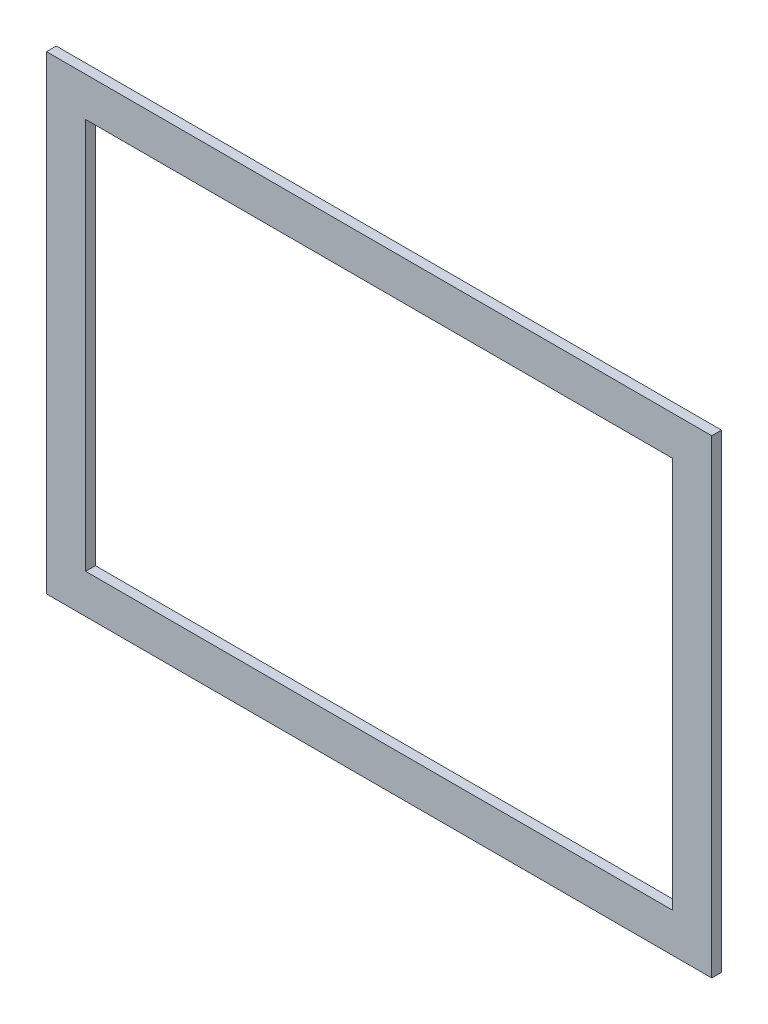
ISO-10303-21;
HEADER;
FILE_DESCRIPTION(('STEP AP214'),'2;1');
FILE_NAME('part.step','',(''),(''),'','','');
FILE_SCHEMA(('AUTOMOTIVE_DESIGN { 1 0 10303 214 1 1 1 1 }'));
ENDSEC;
DATA;
#1=APPLICATION_CONTEXT('core data for automotive mechanical design processes');
#2=APPLICATION_PROTOCOL_DEFINITION('international standard','automotive_design',2000,#1);
#3=PRODUCT_CONTEXT('',#1,'mechanical');
#4=PRODUCT('Part','Part','',(#3));
#5=PRODUCT_RELATED_PRODUCT_CATEGORY('part','',(#4));
#6=PRODUCT_DEFINITION_FORMATION('','',#4);
#7=PRODUCT_DEFINITION_CONTEXT('part definition',#1,'design');
#8=PRODUCT_DEFINITION('design','',#6,#7);
#9=PRODUCT_DEFINITION_SHAPE('','',#8);
#10=(LENGTH_UNIT() NAMED_UNIT(*) SI_UNIT(.MILLI.,.METRE.));
#11=(NAMED_UNIT(*) PLANE_ANGLE_UNIT() SI_UNIT($,.RADIAN.));
#12=(NAMED_UNIT(*) SI_UNIT($,.STERADIAN.) SOLID_ANGLE_UNIT());
#13=UNCERTAINTY_MEASURE_WITH_UNIT(LENGTH_MEASURE(1.E-05),#10,'distance_accuracy_value','');
#14=(GEOMETRIC_REPRESENTATION_CONTEXT(3) GLOBAL_UNCERTAINTY_ASSIGNED_CONTEXT((#13)) GLOBAL_UNIT_ASSIGNED_CONTEXT((#10,
#11,#12)) REPRESENTATION_CONTEXT('',''));
#15=CARTESIAN_POINT('',(0.,0.,0.));
#16=DIRECTION('',(0.,0.,1.));
#17=DIRECTION('',(1.,0.,0.));
#18=AXIS2_PLACEMENT_3D('',#15,#16,#17);
#19=CARTESIAN_POINT('',(0.,0.,10.));
#20=DIRECTION('',(0.,0.,1.));
#21=DIRECTION('',(1.,0.,0.));
#22=AXIS2_PLACEMENT_3D('',#19,#20,#21);
#23=PLANE('',#22);
#24=DIRECTION('',(0.,1.,0.));
#25=VECTOR('',#24,1.);
#26=CARTESIAN_POINT('',(0.,0.,10.));
#27=LINE('',#26,#25);
#28=CARTESIAN_POINT('',(0.,0.,10.));
#29=VERTEX_POINT('',#28);
#30=CARTESIAN_POINT('',(0.,480.,10.));
#31=VERTEX_POINT('',#30);
#32=EDGE_CURVE('E134',#29,#31,#27,.T.);
#33=ORIENTED_EDGE('',*,*,#32,.T.);
#34=DIRECTION('',(-1.,0.,0.));
#35=VECTOR('',#34,1.);
#36=CARTESIAN_POINT('',(0.,480.,10.));
#37=LINE('',#36,#35);
#38=CARTESIAN_POINT('',(-680.,480.,10.));
#39=VERTEX_POINT('',#38);
#40=EDGE_CURVE('E137',#31,#39,#37,.T.);
#41=ORIENTED_EDGE('',*,*,#40,.T.);
#42=DIRECTION('',(0.,-1.,0.));
#43=VECTOR('',#42,1.);
#44=CARTESIAN_POINT('',(-680.,0.,10.));
#45=LINE('',#44,#43);
#46=CARTESIAN_POINT('',(-680.,0.,10.));
#47=VERTEX_POINT('',#46);
#48=EDGE_CURVE('E140',#39,#47,#45,.T.);
#49=ORIENTED_EDGE('',*,*,#48,.T.);
#50=DIRECTION('',(1.,0.,0.));
#51=VECTOR('',#50,1.);
#52=CARTESIAN_POINT('',(0.,0.,10.));
#53=LINE('',#52,#51);
#54=EDGE_CURVE('E142',#47,#29,#53,.T.);
#55=ORIENTED_EDGE('',*,*,#54,.T.);
#56=EDGE_LOOP('',(#33,#41,#49,#55));
#57=FACE_BOUND('',#56,.T.);
#58=DIRECTION('',(1.,0.,0.));
#59=VECTOR('',#58,1.);
#60=CARTESIAN_POINT('',(-640.,39.9999999999999,10.));
#61=LINE('',#60,#59);
#62=CARTESIAN_POINT('',(-640.,39.9999999999999,10.));
#63=VERTEX_POINT('',#62);
#64=CARTESIAN_POINT('',(-40.,39.9999999999999,10.));
#65=VERTEX_POINT('',#64);
#66=EDGE_CURVE('E106',#63,#65,#61,.T.);
#67=ORIENTED_EDGE('',*,*,#66,.F.);
#68=DIRECTION('',(0.,-1.,0.));
#69=VECTOR('',#68,1.);
#70=CARTESIAN_POINT('',(-640.,440.,10.));
#71=LINE('',#70,#69);
#72=CARTESIAN_POINT('',(-640.,440.,10.));
#73=VERTEX_POINT('',#72);
#74=EDGE_CURVE('E98',#73,#63,#71,.T.);
#75=ORIENTED_EDGE('',*,*,#74,.F.);
#76=DIRECTION('',(-1.,0.,0.));
#77=VECTOR('',#76,1.);
#78=CARTESIAN_POINT('',(-640.,440.,10.));
#79=LINE('',#78,#77);
#80=CARTESIAN_POINT('',(-40.,440.,10.));
#81=VERTEX_POINT('',#80);
#82=EDGE_CURVE('E120',#81,#73,#79,.T.);
#83=ORIENTED_EDGE('',*,*,#82,.F.);
#84=DIRECTION('',(0.,1.,0.));
#85=VECTOR('',#84,1.);
#86=CARTESIAN_POINT('',(-40.,440.,10.));
#87=LINE('',#86,#85);
#88=EDGE_CURVE('E118',#65,#81,#87,.T.);
#89=ORIENTED_EDGE('',*,*,#88,.F.);
#90=EDGE_LOOP('',(#67,#75,#83,#89));
#91=FACE_BOUND('',#90,.T.);
#92=ADVANCED_FACE('F33',(#57,#91),#23,.T.);
#93=CARTESIAN_POINT('',(0.,0.,0.));
#94=DIRECTION('',(0.,0.,1.));
#95=DIRECTION('',(1.,0.,0.));
#96=AXIS2_PLACEMENT_3D('',#93,#94,#95);
#97=PLANE('',#96);
#98=DIRECTION('',(0.,1.,0.));
#99=VECTOR('',#98,1.);
#100=CARTESIAN_POINT('',(0.,0.,0.));
#101=LINE('',#100,#99);
#102=CARTESIAN_POINT('',(0.,0.,0.));
#103=VERTEX_POINT('',#102);
#104=CARTESIAN_POINT('',(0.,480.,0.));
#105=VERTEX_POINT('',#104);
#106=EDGE_CURVE('E114',#103,#105,#101,.T.);
#107=ORIENTED_EDGE('',*,*,#106,.F.);
#108=DIRECTION('',(1.,0.,0.));
#109=VECTOR('',#108,1.);
#110=CARTESIAN_POINT('',(0.,0.,0.));
#111=LINE('',#110,#109);
#112=CARTESIAN_POINT('',(-680.,0.,0.));
#113=VERTEX_POINT('',#112);
#114=EDGE_CURVE('E138',#113,#103,#111,.T.);
#115=ORIENTED_EDGE('',*,*,#114,.F.);
#116=DIRECTION('',(0.,-1.,0.));
#117=VECTOR('',#116,1.);
#118=CARTESIAN_POINT('',(-680.,0.,0.));
#119=LINE('',#118,#117);
#120=CARTESIAN_POINT('',(-680.,480.,0.));
#121=VERTEX_POINT('',#120);
#122=EDGE_CURVE('E149',#121,#113,#119,.T.);
#123=ORIENTED_EDGE('',*,*,#122,.F.);
#124=DIRECTION('',(-1.,0.,0.));
#125=VECTOR('',#124,1.);
#126=CARTESIAN_POINT('',(0.,480.,0.));
#127=LINE('',#126,#125);
#128=EDGE_CURVE('E147',#105,#121,#127,.T.);
#129=ORIENTED_EDGE('',*,*,#128,.F.);
#130=EDGE_LOOP('',(#107,#115,#123,#129));
#131=FACE_BOUND('',#130,.T.);
#132=DIRECTION('',(0.,-1.,0.));
#133=VECTOR('',#132,1.);
#134=CARTESIAN_POINT('',(-640.,440.,0.));
#135=LINE('',#134,#133);
#136=CARTESIAN_POINT('',(-640.,440.,0.));
#137=VERTEX_POINT('',#136);
#138=CARTESIAN_POINT('',(-640.,39.9999999999999,0.));
#139=VERTEX_POINT('',#138);
#140=EDGE_CURVE('E56',#137,#139,#135,.T.);
#141=ORIENTED_EDGE('',*,*,#140,.T.);
#142=DIRECTION('',(1.,0.,0.));
#143=VECTOR('',#142,1.);
#144=CARTESIAN_POINT('',(-640.,39.9999999999999,0.));
#145=LINE('',#144,#143);
#146=CARTESIAN_POINT('',(-40.,39.9999999999999,0.));
#147=VERTEX_POINT('',#146);
#148=EDGE_CURVE('E113',#139,#147,#145,.T.);
#149=ORIENTED_EDGE('',*,*,#148,.T.);
#150=DIRECTION('',(0.,1.,0.));
#151=VECTOR('',#150,1.);
#152=CARTESIAN_POINT('',(-40.,440.,0.));
#153=LINE('',#152,#151);
#154=CARTESIAN_POINT('',(-40.,440.,0.));
#155=VERTEX_POINT('',#154);
#156=EDGE_CURVE('E126',#147,#155,#153,.T.);
#157=ORIENTED_EDGE('',*,*,#156,.T.);
#158=DIRECTION('',(-1.,0.,0.));
#159=VECTOR('',#158,1.);
#160=CARTESIAN_POINT('',(-640.,440.,0.));
#161=LINE('',#160,#159);
#162=EDGE_CURVE('E107',#155,#137,#161,.T.);
#163=ORIENTED_EDGE('',*,*,#162,.T.);
#164=EDGE_LOOP('',(#141,#149,#157,#163));
#165=FACE_BOUND('',#164,.T.);
#166=ADVANCED_FACE('F167',(#131,#165),#97,.F.);
#167=CARTESIAN_POINT('',(0.,0.,10.));
#168=DIRECTION('',(-1.,0.,0.));
#169=DIRECTION('',(0.,0.,1.));
#170=AXIS2_PLACEMENT_3D('',#167,#168,#169);
#171=PLANE('',#170);
#172=ORIENTED_EDGE('',*,*,#106,.T.);
#173=DIRECTION('',(0.,0.,-1.));
#174=VECTOR('',#173,1.);
#175=CARTESIAN_POINT('',(0.,480.,10.));
#176=LINE('',#175,#174);
#177=EDGE_CURVE('E11',#31,#105,#176,.T.);
#178=ORIENTED_EDGE('',*,*,#177,.F.);
#179=ORIENTED_EDGE('',*,*,#32,.F.);
#180=DIRECTION('',(0.,0.,-1.));
#181=VECTOR('',#180,1.);
#182=CARTESIAN_POINT('',(0.,0.,10.));
#183=LINE('',#182,#181);
#184=EDGE_CURVE('E144',#29,#103,#183,.T.);
#185=ORIENTED_EDGE('',*,*,#184,.T.);
#186=EDGE_LOOP('',(#172,#178,#179,#185));
#187=FACE_BOUND('',#186,.T.);
#188=ADVANCED_FACE('F35',(#187),#171,.F.);
#189=CARTESIAN_POINT('',(0.,480.,10.));
#190=DIRECTION('',(0.,-1.,0.));
#191=DIRECTION('',(1.,0.,0.));
#192=AXIS2_PLACEMENT_3D('',#189,#190,#191);
#193=PLANE('',#192);
#194=ORIENTED_EDGE('',*,*,#128,.T.);
#195=DIRECTION('',(0.,0.,-1.));
#196=VECTOR('',#195,1.);
#197=CARTESIAN_POINT('',(-680.,480.,10.));
#198=LINE('',#197,#196);
#199=EDGE_CURVE('E41',#39,#121,#198,.T.);
#200=ORIENTED_EDGE('',*,*,#199,.F.);
#201=ORIENTED_EDGE('',*,*,#40,.F.);
#202=ORIENTED_EDGE('',*,*,#177,.T.);
#203=EDGE_LOOP('',(#194,#200,#201,#202));
#204=FACE_BOUND('',#203,.T.);
#205=ADVANCED_FACE('F177',(#204),#193,.F.);
#206=CARTESIAN_POINT('',(-680.,0.,10.));
#207=DIRECTION('',(1.,0.,0.));
#208=DIRECTION('',(0.,0.,-1.));
#209=AXIS2_PLACEMENT_3D('',#206,#207,#208);
#210=PLANE('',#209);
#211=ORIENTED_EDGE('',*,*,#122,.T.);
#212=DIRECTION('',(0.,0.,-1.));
#213=VECTOR('',#212,1.);
#214=CARTESIAN_POINT('',(-680.,0.,10.));
#215=LINE('',#214,#213);
#216=EDGE_CURVE('E154',#47,#113,#215,.T.);
#217=ORIENTED_EDGE('',*,*,#216,.F.);
#218=ORIENTED_EDGE('',*,*,#48,.F.);
#219=ORIENTED_EDGE('',*,*,#199,.T.);
#220=EDGE_LOOP('',(#211,#217,#218,#219));
#221=FACE_BOUND('',#220,.T.);
#222=ADVANCED_FACE('F161',(#221),#210,.F.);
#223=CARTESIAN_POINT('',(0.,0.,10.));
#224=DIRECTION('',(0.,1.,0.));
#225=DIRECTION('',(0.,0.,1.));
#226=AXIS2_PLACEMENT_3D('',#223,#224,#225);
#227=PLANE('',#226);
#228=ORIENTED_EDGE('',*,*,#114,.T.);
#229=ORIENTED_EDGE('',*,*,#184,.F.);
#230=ORIENTED_EDGE('',*,*,#54,.F.);
#231=ORIENTED_EDGE('',*,*,#216,.T.);
#232=EDGE_LOOP('',(#228,#229,#230,#231));
#233=FACE_BOUND('',#232,.T.);
#234=ADVANCED_FACE('F171',(#233),#227,.F.);
#235=CARTESIAN_POINT('',(-640.,440.,10.));
#236=DIRECTION('',(1.,0.,0.));
#237=DIRECTION('',(0.,0.,-1.));
#238=AXIS2_PLACEMENT_3D('',#235,#236,#237);
#239=PLANE('',#238);
#240=ORIENTED_EDGE('',*,*,#140,.F.);
#241=DIRECTION('',(0.,0.,-1.));
#242=VECTOR('',#241,1.);
#243=CARTESIAN_POINT('',(-640.,440.,10.));
#244=LINE('',#243,#242);
#245=EDGE_CURVE('E102',#73,#137,#244,.T.);
#246=ORIENTED_EDGE('',*,*,#245,.F.);
#247=ORIENTED_EDGE('',*,*,#74,.T.);
#248=DIRECTION('',(0.,0.,-1.));
#249=VECTOR('',#248,1.);
#250=CARTESIAN_POINT('',(-640.,39.9999999999999,10.));
#251=LINE('',#250,#249);
#252=EDGE_CURVE('E101',#63,#139,#251,.T.);
#253=ORIENTED_EDGE('',*,*,#252,.T.);
#254=EDGE_LOOP('',(#240,#246,#247,#253));
#255=FACE_BOUND('',#254,.T.);
#256=ADVANCED_FACE('F100',(#255),#239,.T.);
#257=CARTESIAN_POINT('',(-640.,39.9999999999999,10.));
#258=DIRECTION('',(0.,1.,0.));
#259=DIRECTION('',(0.,0.,1.));
#260=AXIS2_PLACEMENT_3D('',#257,#258,#259);
#261=PLANE('',#260);
#262=ORIENTED_EDGE('',*,*,#148,.F.);
#263=ORIENTED_EDGE('',*,*,#252,.F.);
#264=ORIENTED_EDGE('',*,*,#66,.T.);
#265=DIRECTION('',(0.,0.,-1.));
#266=VECTOR('',#265,1.);
#267=CARTESIAN_POINT('',(-40.,39.9999999999999,10.));
#268=LINE('',#267,#266);
#269=EDGE_CURVE('E115',#65,#147,#268,.T.);
#270=ORIENTED_EDGE('',*,*,#269,.T.);
#271=EDGE_LOOP('',(#262,#263,#264,#270));
#272=FACE_BOUND('',#271,.T.);
#273=ADVANCED_FACE('F110',(#272),#261,.T.);
#274=CARTESIAN_POINT('',(-40.,440.,10.));
#275=DIRECTION('',(-1.,0.,0.));
#276=DIRECTION('',(0.,0.,1.));
#277=AXIS2_PLACEMENT_3D('',#274,#275,#276);
#278=PLANE('',#277);
#279=ORIENTED_EDGE('',*,*,#156,.F.);
#280=ORIENTED_EDGE('',*,*,#269,.F.);
#281=ORIENTED_EDGE('',*,*,#88,.T.);
#282=DIRECTION('',(0.,0.,-1.));
#283=VECTOR('',#282,1.);
#284=CARTESIAN_POINT('',(-40.,440.,10.));
#285=LINE('',#284,#283);
#286=EDGE_CURVE('E48',#81,#155,#285,.T.);
#287=ORIENTED_EDGE('',*,*,#286,.T.);
#288=EDGE_LOOP('',(#279,#280,#281,#287));
#289=FACE_BOUND('',#288,.T.);
#290=ADVANCED_FACE('F200',(#289),#278,.T.);
#291=CARTESIAN_POINT('',(-640.,440.,10.));
#292=DIRECTION('',(0.,-1.,0.));
#293=DIRECTION('',(0.,0.,-1.));
#294=AXIS2_PLACEMENT_3D('',#291,#292,#293);
#295=PLANE('',#294);
#296=ORIENTED_EDGE('',*,*,#162,.F.);
#297=ORIENTED_EDGE('',*,*,#286,.F.);
#298=ORIENTED_EDGE('',*,*,#82,.T.);
#299=ORIENTED_EDGE('',*,*,#245,.T.);
#300=EDGE_LOOP('',(#296,#297,#298,#299));
#301=FACE_BOUND('',#300,.T.);
#302=ADVANCED_FACE('F204',(#301),#295,.T.);
#303=CLOSED_SHELL('',(#92,#166,#188,#205,#222,#234,#256,#273,#290,#302));
#304=MANIFOLD_SOLID_BREP('B2',#303);
#305=ADVANCED_BREP_SHAPE_REPRESENTATION('',(#18,#304),#14);
#306=SHAPE_DEFINITION_REPRESENTATION(#9,#305);
ENDSEC;
END-ISO-10303-21;
